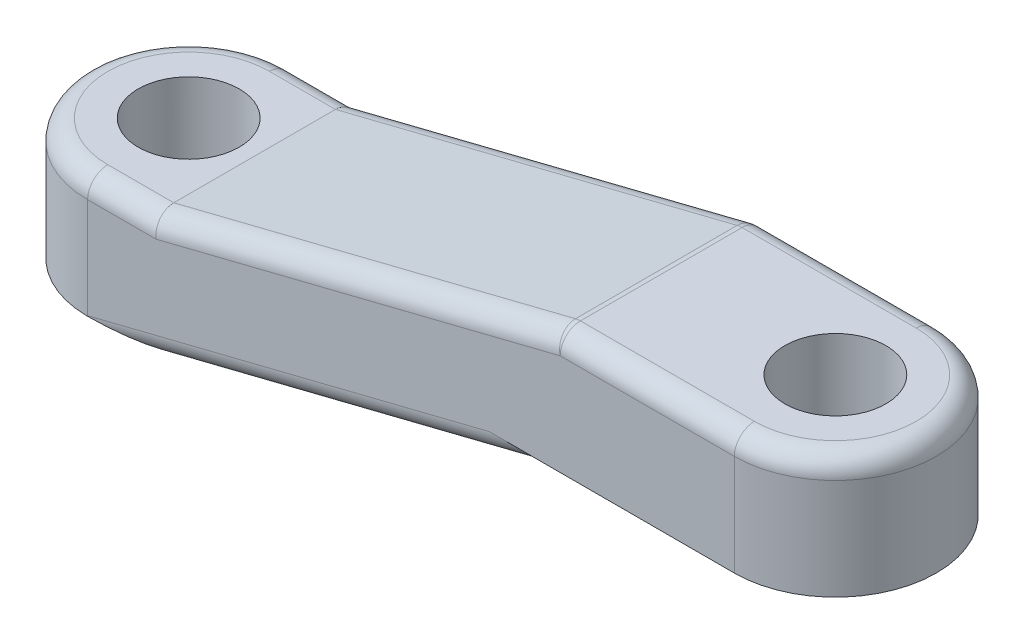
ISO-10303-21;
HEADER;
FILE_DESCRIPTION(('STEP AP214'),'2;1');
FILE_NAME('part.step','',(''),(''),'','','');
FILE_SCHEMA(('AUTOMOTIVE_DESIGN { 1 0 10303 214 1 1 1 1 }'));
ENDSEC;
DATA;
#1=APPLICATION_CONTEXT('core data for automotive mechanical design processes');
#2=APPLICATION_PROTOCOL_DEFINITION('international standard','automotive_design',2000,#1);
#3=PRODUCT_CONTEXT('',#1,'mechanical');
#4=PRODUCT('Part','Part','',(#3));
#5=PRODUCT_RELATED_PRODUCT_CATEGORY('part','',(#4));
#6=PRODUCT_DEFINITION_FORMATION('','',#4);
#7=PRODUCT_DEFINITION_CONTEXT('part definition',#1,'design');
#8=PRODUCT_DEFINITION('design','',#6,#7);
#9=PRODUCT_DEFINITION_SHAPE('','',#8);
#10=(LENGTH_UNIT() NAMED_UNIT(*) SI_UNIT(.MILLI.,.METRE.));
#11=(NAMED_UNIT(*) PLANE_ANGLE_UNIT() SI_UNIT($,.RADIAN.));
#12=(NAMED_UNIT(*) SI_UNIT($,.STERADIAN.) SOLID_ANGLE_UNIT());
#13=UNCERTAINTY_MEASURE_WITH_UNIT(LENGTH_MEASURE(1.E-05),#10,'distance_accuracy_value','');
#14=(GEOMETRIC_REPRESENTATION_CONTEXT(3) GLOBAL_UNCERTAINTY_ASSIGNED_CONTEXT((#13)) GLOBAL_UNIT_ASSIGNED_CONTEXT((#10,
#11,#12)) REPRESENTATION_CONTEXT('',''));
#15=CARTESIAN_POINT('',(0.,0.,0.));
#16=DIRECTION('',(0.,0.,1.));
#17=DIRECTION('',(1.,0.,0.));
#18=AXIS2_PLACEMENT_3D('',#15,#16,#17);
#19=CARTESIAN_POINT('',(-5.08,0.,12.7));
#20=DIRECTION('',(0.,1.,0.));
#21=DIRECTION('',(0.,0.,1.));
#22=AXIS2_PLACEMENT_3D('',#19,#20,#21);
#23=PLANE('',#22);
#24=CARTESIAN_POINT('',(-5.08,0.,6.35));
#25=DIRECTION('',(0.,1.,0.));
#26=DIRECTION('',(0.,0.,1.));
#27=AXIS2_PLACEMENT_3D('',#24,#25,#26);
#28=CIRCLE('',#27,3.175);
#29=CARTESIAN_POINT('',(-5.08,0.,9.525));
#30=VERTEX_POINT('',#29);
#31=EDGE_CURVE('E202',#30,#30,#28,.T.);
#32=ORIENTED_EDGE('',*,*,#31,.T.);
#33=EDGE_LOOP('',(#32));
#34=FACE_BOUND('',#33,.T.);
#35=CARTESIAN_POINT('',(-5.08,0.,6.35));
#36=DIRECTION('',(0.,1.,0.));
#37=DIRECTION('',(0.,0.,1.));
#38=AXIS2_PLACEMENT_3D('',#35,#36,#37);
#39=CIRCLE('',#38,6.35);
#40=CARTESIAN_POINT('',(-5.13497642502094,0.,12.6997620107128));
#41=VERTEX_POINT('',#40);
#42=CARTESIAN_POINT('',(-5.1349764249227,0.,0.00023798928734664));
#43=VERTEX_POINT('',#42);
#44=EDGE_CURVE('E175',#41,#43,#39,.F.);
#45=ORIENTED_EDGE('',*,*,#44,.T.);
#46=CARTESIAN_POINT('',(-5.23634414453443,0.,1.27));
#47=DIRECTION('',(0.,1.,0.));
#48=DIRECTION('',(1.,0.,0.));
#49=AXIS2_PLACEMENT_3D('',#46,#47,#48);
#50=ELLIPSE('',#49,5.23634414453443,1.27);
#51=CARTESIAN_POINT('',(0.,0.,1.27));
#52=VERTEX_POINT('',#51);
#53=EDGE_CURVE('E307',#43,#52,#50,.F.);
#54=ORIENTED_EDGE('',*,*,#53,.T.);
#55=DIRECTION('',(0.,0.,-1.));
#56=VECTOR('',#55,1.);
#57=CARTESIAN_POINT('',(0.,0.,12.7));
#58=LINE('',#57,#56);
#59=CARTESIAN_POINT('',(0.,0.,11.43));
#60=VERTEX_POINT('',#59);
#61=EDGE_CURVE('E195',#60,#52,#58,.T.);
#62=ORIENTED_EDGE('',*,*,#61,.F.);
#63=CARTESIAN_POINT('',(-5.23634414453443,0.,11.43));
#64=DIRECTION('',(0.,1.,0.));
#65=DIRECTION('',(-1.,0.,0.));
#66=AXIS2_PLACEMENT_3D('',#63,#64,#65);
#67=ELLIPSE('',#66,5.23634414453443,1.27);
#68=EDGE_CURVE('E311',#60,#41,#67,.F.);
#69=ORIENTED_EDGE('',*,*,#68,.T.);
#70=EDGE_LOOP('',(#45,#54,#62,#69));
#71=FACE_BOUND('',#70,.T.);
#72=ADVANCED_FACE('F43',(#34,#71),#23,.F.);
#73=CARTESIAN_POINT('',(0.,0.,12.7));
#74=DIRECTION('',(-0.242535625036333,0.970142500145332,0.));
#75=DIRECTION('',(-0.970142500145332,-0.242535625036333,0.));
#76=AXIS2_PLACEMENT_3D('',#73,#74,#75);
#77=PLANE('',#76);
#78=ORIENTED_EDGE('',*,*,#61,.T.);
#79=DIRECTION('',(0.970142500145332,0.242535625036333,0.));
#80=VECTOR('',#79,1.);
#81=CARTESIAN_POINT('',(0.,0.,1.27));
#82=LINE('',#81,#80);
#83=CARTESIAN_POINT('',(25.4,6.35,1.27));
#84=VERTEX_POINT('',#83);
#85=EDGE_CURVE('E204',#52,#84,#82,.T.);
#86=ORIENTED_EDGE('',*,*,#85,.T.);
#87=DIRECTION('',(0.,0.,-1.));
#88=VECTOR('',#87,1.);
#89=CARTESIAN_POINT('',(25.4,6.35,12.7));
#90=LINE('',#89,#88);
#91=CARTESIAN_POINT('',(25.4,6.35,11.43));
#92=VERTEX_POINT('',#91);
#93=EDGE_CURVE('E184',#92,#84,#90,.T.);
#94=ORIENTED_EDGE('',*,*,#93,.F.);
#95=DIRECTION('',(0.970142500145332,0.242535625036333,0.));
#96=VECTOR('',#95,1.);
#97=CARTESIAN_POINT('',(0.,0.,11.43));
#98=LINE('',#97,#96);
#99=EDGE_CURVE('E198',#92,#60,#98,.F.);
#100=ORIENTED_EDGE('',*,*,#99,.T.);
#101=EDGE_LOOP('',(#78,#86,#94,#100));
#102=FACE_BOUND('',#101,.T.);
#103=ADVANCED_FACE('F279',(#102),#77,.F.);
#104=CARTESIAN_POINT('',(25.4,6.35,12.7));
#105=DIRECTION('',(0.,1.,0.));
#106=DIRECTION('',(0.,0.,1.));
#107=AXIS2_PLACEMENT_3D('',#104,#105,#106);
#108=PLANE('',#107);
#109=CARTESIAN_POINT('',(35.56,6.35,6.35));
#110=DIRECTION('',(0.,1.,0.));
#111=DIRECTION('',(0.,0.,1.));
#112=AXIS2_PLACEMENT_3D('',#109,#110,#111);
#113=CIRCLE('',#112,3.175);
#114=CARTESIAN_POINT('',(35.56,6.35,9.525));
#115=VERTEX_POINT('',#114);
#116=EDGE_CURVE('E176',#115,#115,#113,.F.);
#117=ORIENTED_EDGE('',*,*,#116,.F.);
#118=EDGE_LOOP('',(#117));
#119=FACE_BOUND('',#118,.T.);
#120=DIRECTION('',(1.,0.,0.));
#121=VECTOR('',#120,1.);
#122=CARTESIAN_POINT('',(25.4,6.35,0.));
#123=LINE('',#122,#121);
#124=CARTESIAN_POINT('',(20.1636558554656,6.35,0.));
#125=VERTEX_POINT('',#124);
#126=CARTESIAN_POINT('',(35.56,6.35,0.));
#127=VERTEX_POINT('',#126);
#128=EDGE_CURVE('E171',#125,#127,#123,.T.);
#129=ORIENTED_EDGE('',*,*,#128,.T.);
#130=CARTESIAN_POINT('',(35.56,6.35,6.35));
#131=DIRECTION('',(0.,1.,0.));
#132=DIRECTION('',(0.,0.,1.));
#133=AXIS2_PLACEMENT_3D('',#130,#131,#132);
#134=CIRCLE('',#133,6.35);
#135=CARTESIAN_POINT('',(35.56,6.35,12.7));
#136=VERTEX_POINT('',#135);
#137=EDGE_CURVE('E168',#127,#136,#134,.F.);
#138=ORIENTED_EDGE('',*,*,#137,.T.);
#139=DIRECTION('',(1.,0.,0.));
#140=VECTOR('',#139,1.);
#141=CARTESIAN_POINT('',(25.4,6.35,12.7));
#142=LINE('',#141,#140);
#143=CARTESIAN_POINT('',(20.1636558554656,6.35,12.7));
#144=VERTEX_POINT('',#143);
#145=EDGE_CURVE('E154',#144,#136,#142,.T.);
#146=ORIENTED_EDGE('',*,*,#145,.F.);
#147=CARTESIAN_POINT('',(20.1636558554656,6.35,11.43));
#148=DIRECTION('',(0.,1.,0.));
#149=DIRECTION('',(-1.,0.,0.));
#150=AXIS2_PLACEMENT_3D('',#147,#148,#149);
#151=ELLIPSE('',#150,5.23634414453443,1.27);
#152=EDGE_CURVE('E327',#144,#92,#151,.T.);
#153=ORIENTED_EDGE('',*,*,#152,.T.);
#154=ORIENTED_EDGE('',*,*,#93,.T.);
#155=CARTESIAN_POINT('',(20.1636558554656,6.35,1.27));
#156=DIRECTION('',(0.,1.,0.));
#157=DIRECTION('',(1.,0.,0.));
#158=AXIS2_PLACEMENT_3D('',#155,#156,#157);
#159=ELLIPSE('',#158,5.23634414453443,1.27);
#160=EDGE_CURVE('E325',#84,#125,#159,.T.);
#161=ORIENTED_EDGE('',*,*,#160,.T.);
#162=EDGE_LOOP('',(#129,#138,#146,#153,#154,#161));
#163=FACE_BOUND('',#162,.T.);
#164=ADVANCED_FACE('F169',(#119,#163),#108,.F.);
#165=CARTESIAN_POINT('',(24.4619351327934,13.97,12.7));
#166=DIRECTION('',(0.,-1.,0.));
#167=DIRECTION('',(0.,0.,-1.));
#168=AXIS2_PLACEMENT_3D('',#165,#166,#167);
#169=PLANE('',#168);
#170=DIRECTION('',(0.,0.,-1.));
#171=VECTOR('',#170,1.);
#172=CARTESIAN_POINT('',(24.6182792773279,13.97,12.7));
#173=LINE('',#172,#171);
#174=CARTESIAN_POINT('',(24.6182792773279,13.97,1.27));
#175=VERTEX_POINT('',#174);
#176=CARTESIAN_POINT('',(24.6182792773279,13.97,11.43));
#177=VERTEX_POINT('',#176);
#178=EDGE_CURVE('E337',#175,#177,#173,.F.);
#179=ORIENTED_EDGE('',*,*,#178,.T.);
#180=DIRECTION('',(-1.,0.,0.));
#181=VECTOR('',#180,1.);
#182=CARTESIAN_POINT('',(35.56,13.97,11.43));
#183=LINE('',#182,#181);
#184=CARTESIAN_POINT('',(35.56,13.97,11.43));
#185=VERTEX_POINT('',#184);
#186=EDGE_CURVE('E339',#177,#185,#183,.F.);
#187=ORIENTED_EDGE('',*,*,#186,.T.);
#188=CARTESIAN_POINT('',(35.56,13.97,6.35));
#189=DIRECTION('',(0.,-1.,0.));
#190=DIRECTION('',(0.,0.,-1.));
#191=AXIS2_PLACEMENT_3D('',#188,#189,#190);
#192=CIRCLE('',#191,5.08);
#193=CARTESIAN_POINT('',(35.56,13.97,1.27));
#194=VERTEX_POINT('',#193);
#195=EDGE_CURVE('E333',#185,#194,#192,.F.);
#196=ORIENTED_EDGE('',*,*,#195,.T.);
#197=DIRECTION('',(-1.,0.,0.));
#198=VECTOR('',#197,1.);
#199=CARTESIAN_POINT('',(24.4619351327934,13.97,1.27));
#200=LINE('',#199,#198);
#201=EDGE_CURVE('E335',#194,#175,#200,.T.);
#202=ORIENTED_EDGE('',*,*,#201,.T.);
#203=EDGE_LOOP('',(#179,#187,#196,#202));
#204=FACE_BOUND('',#203,.T.);
#205=CARTESIAN_POINT('',(35.56,13.97,6.35));
#206=DIRECTION('',(0.,1.,0.));
#207=DIRECTION('',(0.,0.,1.));
#208=AXIS2_PLACEMENT_3D('',#205,#206,#207);
#209=CIRCLE('',#208,3.175);
#210=CARTESIAN_POINT('',(35.56,13.97,9.525));
#211=VERTEX_POINT('',#210);
#212=EDGE_CURVE('E377',#211,#211,#209,.T.);
#213=ORIENTED_EDGE('',*,*,#212,.F.);
#214=EDGE_LOOP('',(#213));
#215=FACE_BOUND('',#214,.T.);
#216=ADVANCED_FACE('F398',(#204,#215),#169,.F.);
#217=CARTESIAN_POINT('',(-0.938064867206577,7.62,12.7));
#218=DIRECTION('',(0.242535625036333,-0.970142500145332,0.));
#219=DIRECTION('',(0.970142500145332,0.242535625036333,0.));
#220=AXIS2_PLACEMENT_3D('',#217,#218,#219);
#221=PLANE('',#220);
#222=DIRECTION('',(-0.970142500145332,-0.242535625036333,0.));
#223=VECTOR('',#222,1.);
#224=CARTESIAN_POINT('',(24.4619351327934,13.97,11.43));
#225=LINE('',#224,#223);
#226=CARTESIAN_POINT('',(-0.938064867206577,7.62,11.43));
#227=VERTEX_POINT('',#226);
#228=CARTESIAN_POINT('',(24.3102590335317,13.9320809751846,11.43));
#229=VERTEX_POINT('',#228);
#230=EDGE_CURVE('E314',#227,#229,#225,.F.);
#231=ORIENTED_EDGE('',*,*,#230,.T.);
#232=DIRECTION('',(0.,0.,-1.));
#233=VECTOR('',#232,1.);
#234=CARTESIAN_POINT('',(24.3102590335317,13.9320809751846,12.7));
#235=LINE('',#234,#233);
#236=CARTESIAN_POINT('',(24.3102590335317,13.9320809751846,1.27));
#237=VERTEX_POINT('',#236);
#238=EDGE_CURVE('E344',#229,#237,#235,.T.);
#239=ORIENTED_EDGE('',*,*,#238,.T.);
#240=DIRECTION('',(-0.970142500145332,-0.242535625036333,0.));
#241=VECTOR('',#240,1.);
#242=CARTESIAN_POINT('',(-0.938064867206577,7.62,1.27));
#243=LINE('',#242,#241);
#244=CARTESIAN_POINT('',(-0.938064867206577,7.62,1.27));
#245=VERTEX_POINT('',#244);
#246=EDGE_CURVE('E319',#237,#245,#243,.T.);
#247=ORIENTED_EDGE('',*,*,#246,.T.);
#248=DIRECTION('',(0.,0.,-1.));
#249=VECTOR('',#248,1.);
#250=CARTESIAN_POINT('',(-0.938064867206577,7.62,12.7));
#251=LINE('',#250,#249);
#252=EDGE_CURVE('E181',#227,#245,#251,.T.);
#253=ORIENTED_EDGE('',*,*,#252,.F.);
#254=EDGE_LOOP('',(#231,#239,#247,#253));
#255=FACE_BOUND('',#254,.T.);
#256=ADVANCED_FACE('F387',(#255),#221,.F.);
#257=CARTESIAN_POINT('',(-5.08,7.62,12.7));
#258=DIRECTION('',(0.,-1.,0.));
#259=DIRECTION('',(0.,0.,-1.));
#260=AXIS2_PLACEMENT_3D('',#257,#258,#259);
#261=PLANE('',#260);
#262=ORIENTED_EDGE('',*,*,#252,.T.);
#263=DIRECTION('',(-1.,0.,0.));
#264=VECTOR('',#263,1.);
#265=CARTESIAN_POINT('',(-5.08,7.62,1.27));
#266=LINE('',#265,#264);
#267=CARTESIAN_POINT('',(-5.08,7.62,1.27));
#268=VERTEX_POINT('',#267);
#269=EDGE_CURVE('E356',#245,#268,#266,.T.);
#270=ORIENTED_EDGE('',*,*,#269,.T.);
#271=CARTESIAN_POINT('',(-5.08,7.62,6.35));
#272=DIRECTION('',(0.,-1.,0.));
#273=DIRECTION('',(0.,0.,-1.));
#274=AXIS2_PLACEMENT_3D('',#271,#272,#273);
#275=CIRCLE('',#274,5.08);
#276=CARTESIAN_POINT('',(-5.08,7.62,11.43));
#277=VERTEX_POINT('',#276);
#278=EDGE_CURVE('E60',#268,#277,#275,.F.);
#279=ORIENTED_EDGE('',*,*,#278,.T.);
#280=DIRECTION('',(-1.,0.,0.));
#281=VECTOR('',#280,1.);
#282=CARTESIAN_POINT('',(4.29827927732785,7.62,11.43));
#283=LINE('',#282,#281);
#284=EDGE_CURVE('E354',#277,#227,#283,.F.);
#285=ORIENTED_EDGE('',*,*,#284,.T.);
#286=EDGE_LOOP('',(#262,#270,#279,#285));
#287=FACE_BOUND('',#286,.T.);
#288=CARTESIAN_POINT('',(-5.08,7.62,6.35));
#289=DIRECTION('',(0.,-1.,0.));
#290=DIRECTION('',(0.,0.,-1.));
#291=AXIS2_PLACEMENT_3D('',#288,#289,#290);
#292=CIRCLE('',#291,3.175);
#293=CARTESIAN_POINT('',(-5.08,7.62,3.175));
#294=VERTEX_POINT('',#293);
#295=EDGE_CURVE('E199',#294,#294,#292,.F.);
#296=ORIENTED_EDGE('',*,*,#295,.F.);
#297=EDGE_LOOP('',(#296));
#298=FACE_BOUND('',#297,.T.);
#299=ADVANCED_FACE('F383',(#287,#298),#261,.F.);
#300=CARTESIAN_POINT('',(0.,0.,12.7));
#301=DIRECTION('',(0.,0.,1.));
#302=DIRECTION('',(1.,0.,0.));
#303=AXIS2_PLACEMENT_3D('',#300,#301,#302);
#304=PLANE('',#303);
#305=DIRECTION('',(0.,1.,0.));
#306=VECTOR('',#305,1.);
#307=CARTESIAN_POINT('',(35.56,13.97,12.7));
#308=LINE('',#307,#306);
#309=CARTESIAN_POINT('',(35.56,12.7,12.7));
#310=VERTEX_POINT('',#309);
#311=EDGE_CURVE('E159',#136,#310,#308,.T.);
#312=ORIENTED_EDGE('',*,*,#311,.T.);
#313=DIRECTION('',(-1.,0.,0.));
#314=VECTOR('',#313,1.);
#315=CARTESIAN_POINT('',(29.6982792773279,12.7,12.7));
#316=LINE('',#315,#314);
#317=CARTESIAN_POINT('',(24.6182792773279,12.7,12.7));
#318=VERTEX_POINT('',#317);
#319=EDGE_CURVE('E331',#310,#318,#316,.T.);
#320=ORIENTED_EDGE('',*,*,#319,.T.);
#321=DIRECTION('',(-0.970142500145332,-0.242535625036333,0.));
#322=VECTOR('',#321,1.);
#323=CARTESIAN_POINT('',(-0.630044623410434,6.38791902481543,12.7));
#324=LINE('',#323,#322);
#325=CARTESIAN_POINT('',(-0.781720722672151,6.35,12.7));
#326=VERTEX_POINT('',#325);
#327=EDGE_CURVE('E322',#318,#326,#324,.T.);
#328=ORIENTED_EDGE('',*,*,#327,.T.);
#329=DIRECTION('',(-1.,0.,0.));
#330=VECTOR('',#329,1.);
#331=CARTESIAN_POINT('',(-5.08,6.35,12.7));
#332=LINE('',#331,#330);
#333=CARTESIAN_POINT('',(-5.08,6.35,12.7));
#334=VERTEX_POINT('',#333);
#335=EDGE_CURVE('E329',#326,#334,#332,.T.);
#336=ORIENTED_EDGE('',*,*,#335,.T.);
#337=DIRECTION('',(0.,-1.,0.));
#338=VECTOR('',#337,1.);
#339=CARTESIAN_POINT('',(-5.08,7.62,12.7));
#340=LINE('',#339,#338);
#341=CARTESIAN_POINT('',(-5.08,0.0390860361336081,12.7));
#342=VERTEX_POINT('',#341);
#343=EDGE_CURVE('E165',#334,#342,#340,.T.);
#344=ORIENTED_EDGE('',*,*,#343,.T.);
#345=DIRECTION('',(0.970142500145332,0.242535625036333,0.));
#346=VECTOR('',#345,1.);
#347=CARTESIAN_POINT('',(25.0919797562039,7.58208097518457,12.7));
#348=LINE('',#347,#346);
#349=EDGE_CURVE('E162',#342,#144,#348,.T.);
#350=ORIENTED_EDGE('',*,*,#349,.T.);
#351=ORIENTED_EDGE('',*,*,#145,.T.);
#352=EDGE_LOOP('',(#312,#320,#328,#336,#344,#350,#351));
#353=FACE_BOUND('',#352,.T.);
#354=ADVANCED_FACE('F156',(#353),#304,.T.);
#355=CARTESIAN_POINT('',(0.,0.,0.));
#356=DIRECTION('',(0.,0.,1.));
#357=DIRECTION('',(1.,0.,0.));
#358=AXIS2_PLACEMENT_3D('',#355,#356,#357);
#359=PLANE('',#358);
#360=DIRECTION('',(-0.970142500145332,-0.242535625036333,0.));
#361=VECTOR('',#360,1.);
#362=CARTESIAN_POINT('',(-1.54010121898071,6.16040487592286,0.));
#363=LINE('',#362,#361);
#364=CARTESIAN_POINT('',(-0.781720722672144,6.35,0.));
#365=VERTEX_POINT('',#364);
#366=CARTESIAN_POINT('',(24.6182792773279,12.7,0.));
#367=VERTEX_POINT('',#366);
#368=EDGE_CURVE('E207',#365,#367,#363,.F.);
#369=ORIENTED_EDGE('',*,*,#368,.T.);
#370=DIRECTION('',(-1.,0.,0.));
#371=VECTOR('',#370,1.);
#372=CARTESIAN_POINT('',(0.,12.7,0.));
#373=LINE('',#372,#371);
#374=CARTESIAN_POINT('',(35.56,12.7,0.));
#375=VERTEX_POINT('',#374);
#376=EDGE_CURVE('E351',#367,#375,#373,.F.);
#377=ORIENTED_EDGE('',*,*,#376,.T.);
#378=DIRECTION('',(0.,1.,0.));
#379=VECTOR('',#378,1.);
#380=CARTESIAN_POINT('',(35.56,13.97,0.));
#381=LINE('',#380,#379);
#382=EDGE_CURVE('E191',#127,#375,#381,.T.);
#383=ORIENTED_EDGE('',*,*,#382,.F.);
#384=ORIENTED_EDGE('',*,*,#128,.F.);
#385=DIRECTION('',(0.970142500145332,0.242535625036333,0.));
#386=VECTOR('',#385,1.);
#387=CARTESIAN_POINT('',(-0.308020243796143,1.23208097518457,0.));
#388=LINE('',#387,#386);
#389=CARTESIAN_POINT('',(-5.08,0.0390860361336089,0.));
#390=VERTEX_POINT('',#389);
#391=EDGE_CURVE('E210',#125,#390,#388,.F.);
#392=ORIENTED_EDGE('',*,*,#391,.T.);
#393=DIRECTION('',(0.,-1.,0.));
#394=VECTOR('',#393,1.);
#395=CARTESIAN_POINT('',(-5.08,7.62,0.));
#396=LINE('',#395,#394);
#397=CARTESIAN_POINT('',(-5.08,6.35,0.));
#398=VERTEX_POINT('',#397);
#399=EDGE_CURVE('E188',#398,#390,#396,.T.);
#400=ORIENTED_EDGE('',*,*,#399,.F.);
#401=DIRECTION('',(-1.,0.,0.));
#402=VECTOR('',#401,1.);
#403=CARTESIAN_POINT('',(0.,6.35,0.));
#404=LINE('',#403,#402);
#405=EDGE_CURVE('E348',#398,#365,#404,.F.);
#406=ORIENTED_EDGE('',*,*,#405,.T.);
#407=EDGE_LOOP('',(#369,#377,#383,#384,#392,#400,#406));
#408=FACE_BOUND('',#407,.T.);
#409=ADVANCED_FACE('F409',(#408),#359,.F.);
#410=CARTESIAN_POINT('',(-5.08,-14.1990316571237,6.35));
#411=DIRECTION('',(0.,1.,0.));
#412=DIRECTION('',(0.,0.,1.));
#413=AXIS2_PLACEMENT_3D('',#410,#411,#412);
#414=CYLINDRICAL_SURFACE('',#413,6.35);
#415=ORIENTED_EDGE('',*,*,#343,.F.);
#416=CARTESIAN_POINT('',(-5.08,6.35,6.35));
#417=DIRECTION('',(0.,-1.,0.));
#418=DIRECTION('',(0.,0.,-1.));
#419=AXIS2_PLACEMENT_3D('',#416,#417,#418);
#420=CIRCLE('',#419,6.35);
#421=EDGE_CURVE('E359',#334,#398,#420,.T.);
#422=ORIENTED_EDGE('',*,*,#421,.T.);
#423=ORIENTED_EDGE('',*,*,#399,.T.);
#424=CARTESIAN_POINT('',(-5.13497642502028,0.,0.000237989287157556));
#425=CARTESIAN_POINT('',(-5.12109177199258,0.00987113413457907,0.00011777755086104));
#426=CARTESIAN_POINT('',(-5.10720712839361,0.0197424873696676,4.31062936630522E-05));
#427=CARTESIAN_POINT('',(-5.08888166185105,0.0327713627682106,4.65838838338354E-06));
#428=CARTESIAN_POINT('',(-5.08444083044327,0.0359286882443244,-1.16804444295617E-10));
#429=CARTESIAN_POINT('',(-5.08,0.0390860361336072,0.));
#430=B_SPLINE_CURVE_WITH_KNOTS('',3,(#424,#425,#426,#427,#428,#429),.UNSPECIFIED.,.F.,.F.,(4,2,
4),(0.,0.0511086359163592,0.0674551152041372),.UNSPECIFIED.);
#431=EDGE_CURVE('E222',#390,#43,#430,.F.);
#432=ORIENTED_EDGE('',*,*,#431,.T.);
#433=ORIENTED_EDGE('',*,*,#44,.F.);
#434=CARTESIAN_POINT('',(-5.13497642502094,0.,12.6997620107128));
#435=CARTESIAN_POINT('',(-5.12109177199312,0.00987113413472761,12.6998822224491));
#436=CARTESIAN_POINT('',(-5.10720712839397,0.019742487369871,12.6999568937063));
#437=CARTESIAN_POINT('',(-5.08888166185114,0.0327713627683297,12.6999953416116));
#438=CARTESIAN_POINT('',(-5.08444083044331,0.0359286882443886,12.7000000001168));
#439=CARTESIAN_POINT('',(-5.08,0.0390860361336069,12.7));
#440=B_SPLINE_CURVE_WITH_KNOTS('',3,(#434,#435,#436,#437,#438,#439),.UNSPECIFIED.,.F.,.F.,(4,2,
4),(0.,0.0511086359168935,0.0674551152046722),.UNSPECIFIED.);
#441=EDGE_CURVE('E213',#41,#342,#440,.T.);
#442=ORIENTED_EDGE('',*,*,#441,.T.);
#443=EDGE_LOOP('',(#415,#422,#423,#432,#433,#442));
#444=FACE_BOUND('',#443,.T.);
#445=ADVANCED_FACE('F229',(#444),#414,.T.);
#446=CARTESIAN_POINT('',(35.56,-7.84903165712366,6.35));
#447=DIRECTION('',(0.,1.,0.));
#448=DIRECTION('',(0.,0.,1.));
#449=AXIS2_PLACEMENT_3D('',#446,#447,#448);
#450=CYLINDRICAL_SURFACE('',#449,6.35);
#451=ORIENTED_EDGE('',*,*,#382,.T.);
#452=CARTESIAN_POINT('',(35.56,12.7,6.35));
#453=DIRECTION('',(0.,-1.,0.));
#454=DIRECTION('',(0.,0.,-1.));
#455=AXIS2_PLACEMENT_3D('',#452,#453,#454);
#456=CIRCLE('',#455,6.35);
#457=EDGE_CURVE('E180',#375,#310,#456,.T.);
#458=ORIENTED_EDGE('',*,*,#457,.T.);
#459=ORIENTED_EDGE('',*,*,#311,.F.);
#460=ORIENTED_EDGE('',*,*,#137,.F.);
#461=EDGE_LOOP('',(#451,#458,#459,#460));
#462=FACE_BOUND('',#461,.T.);
#463=ADVANCED_FACE('F178',(#462),#450,.T.);
#464=CARTESIAN_POINT('',(-5.08,13.97,6.35));
#465=DIRECTION('',(0.,-1.,0.));
#466=DIRECTION('',(0.,0.,-1.));
#467=AXIS2_PLACEMENT_3D('',#464,#465,#466);
#468=CYLINDRICAL_SURFACE('',#467,3.175);
#469=ORIENTED_EDGE('',*,*,#31,.F.);
#470=EDGE_LOOP('',(#469));
#471=FACE_BOUND('',#470,.T.);
#472=ORIENTED_EDGE('',*,*,#295,.T.);
#473=EDGE_LOOP('',(#472));
#474=FACE_BOUND('',#473,.T.);
#475=ADVANCED_FACE('F300',(#471,#474),#468,.F.);
#476=CARTESIAN_POINT('',(35.56,13.97,6.35));
#477=DIRECTION('',(0.,-1.,0.));
#478=DIRECTION('',(0.,0.,-1.));
#479=AXIS2_PLACEMENT_3D('',#476,#477,#478);
#480=CYLINDRICAL_SURFACE('',#479,3.175);
#481=ORIENTED_EDGE('',*,*,#212,.T.);
#482=EDGE_LOOP('',(#481));
#483=FACE_BOUND('',#482,.T.);
#484=ORIENTED_EDGE('',*,*,#116,.T.);
#485=EDGE_LOOP('',(#484));
#486=FACE_BOUND('',#485,.T.);
#487=ADVANCED_FACE('F293',(#483,#486),#480,.F.);
#488=CARTESIAN_POINT('',(-0.308020243796143,1.23208097518457,1.27));
#489=DIRECTION('',(0.970142500145332,0.242535625036333,0.));
#490=DIRECTION('',(-0.242535625036333,0.970142500145332,0.));
#491=AXIS2_PLACEMENT_3D('',#488,#489,#490);
#492=CYLINDRICAL_SURFACE('',#491,1.27);
#493=ORIENTED_EDGE('',*,*,#431,.F.);
#494=ORIENTED_EDGE('',*,*,#391,.F.);
#495=ORIENTED_EDGE('',*,*,#160,.F.);
#496=ORIENTED_EDGE('',*,*,#85,.F.);
#497=ORIENTED_EDGE('',*,*,#53,.F.);
#498=EDGE_LOOP('',(#493,#494,#495,#496,#497));
#499=FACE_BOUND('',#498,.T.);
#500=ADVANCED_FACE('F290',(#499),#492,.T.);
#501=CARTESIAN_POINT('',(-0.630044623410434,6.38791902481543,1.27));
#502=DIRECTION('',(-0.970142500145332,-0.242535625036333,0.));
#503=DIRECTION('',(0.242535625036333,-0.970142500145332,0.));
#504=AXIS2_PLACEMENT_3D('',#501,#502,#503);
#505=CYLINDRICAL_SURFACE('',#504,1.27);
#506=ORIENTED_EDGE('',*,*,#246,.F.);
#507=CARTESIAN_POINT('',(24.6182792773279,12.7,1.27));
#508=DIRECTION('',(-0.970142500145332,-0.242535625036333,0.));
#509=DIRECTION('',(0.242535625036333,-0.970142500145332,0.));
#510=AXIS2_PLACEMENT_3D('',#507,#508,#509);
#511=CIRCLE('',#510,1.27);
#512=EDGE_CURVE('E346',#237,#367,#511,.T.);
#513=ORIENTED_EDGE('',*,*,#512,.T.);
#514=ORIENTED_EDGE('',*,*,#368,.F.);
#515=CARTESIAN_POINT('',(-0.781720722672153,6.35,1.27));
#516=DIRECTION('',(-0.992507556682903,-0.122183263695704,0.));
#517=DIRECTION('',(-0.122183263695705,0.992507556682903,0.));
#518=AXIS2_PLACEMENT_3D('',#515,#516,#517);
#519=ELLIPSE('',#518,1.27958723482622,1.27);
#520=EDGE_CURVE('E52',#365,#245,#519,.F.);
#521=ORIENTED_EDGE('',*,*,#520,.T.);
#522=EDGE_LOOP('',(#506,#513,#514,#521));
#523=FACE_BOUND('',#522,.T.);
#524=ADVANCED_FACE('F239',(#523),#505,.T.);
#525=CARTESIAN_POINT('',(-0.308020243796143,1.23208097518457,11.43));
#526=DIRECTION('',(-0.970142500145332,-0.242535625036333,0.));
#527=DIRECTION('',(0.242535625036333,-0.970142500145332,0.));
#528=AXIS2_PLACEMENT_3D('',#525,#526,#527);
#529=CYLINDRICAL_SURFACE('',#528,1.27);
#530=ORIENTED_EDGE('',*,*,#68,.F.);
#531=ORIENTED_EDGE('',*,*,#99,.F.);
#532=ORIENTED_EDGE('',*,*,#152,.F.);
#533=ORIENTED_EDGE('',*,*,#349,.F.);
#534=ORIENTED_EDGE('',*,*,#441,.F.);
#535=EDGE_LOOP('',(#530,#531,#532,#533,#534));
#536=FACE_BOUND('',#535,.T.);
#537=ADVANCED_FACE('F233',(#536),#529,.T.);
#538=CARTESIAN_POINT('',(-1.54010121898071,6.16040487592286,11.43));
#539=DIRECTION('',(0.970142500145332,0.242535625036333,0.));
#540=DIRECTION('',(-0.242535625036333,0.970142500145332,0.));
#541=AXIS2_PLACEMENT_3D('',#538,#539,#540);
#542=CYLINDRICAL_SURFACE('',#541,1.27);
#543=ORIENTED_EDGE('',*,*,#327,.F.);
#544=CARTESIAN_POINT('',(24.6182792773279,12.7,11.43));
#545=DIRECTION('',(0.970142500145332,0.242535625036333,0.));
#546=DIRECTION('',(-0.242535625036333,0.970142500145332,0.));
#547=AXIS2_PLACEMENT_3D('',#544,#545,#546);
#548=CIRCLE('',#547,1.27);
#549=EDGE_CURVE('E342',#318,#229,#548,.F.);
#550=ORIENTED_EDGE('',*,*,#549,.T.);
#551=ORIENTED_EDGE('',*,*,#230,.F.);
#552=CARTESIAN_POINT('',(-0.781720722672151,6.35,11.43));
#553=DIRECTION('',(0.992507556682903,0.122183263695704,0.));
#554=DIRECTION('',(0.122183263695705,-0.992507556682903,0.));
#555=AXIS2_PLACEMENT_3D('',#552,#553,#554);
#556=ELLIPSE('',#555,1.27958723482622,1.27);
#557=EDGE_CURVE('E11',#227,#326,#556,.T.);
#558=ORIENTED_EDGE('',*,*,#557,.T.);
#559=EDGE_LOOP('',(#543,#550,#551,#558));
#560=FACE_BOUND('',#559,.T.);
#561=ADVANCED_FACE('F238',(#560),#542,.T.);
#562=CARTESIAN_POINT('',(24.6182792773279,12.7,1.27));
#563=DIRECTION('',(0.,-1.,0.));
#564=DIRECTION('',(0.,0.,-1.));
#565=AXIS2_PLACEMENT_3D('',#562,#563,#564);
#566=SPHERICAL_SURFACE('',#565,1.27);
#567=CARTESIAN_POINT('',(24.6182792773279,12.7,1.27));
#568=DIRECTION('',(0.,0.,1.));
#569=DIRECTION('',(1.,0.,0.));
#570=AXIS2_PLACEMENT_3D('',#567,#568,#569);
#571=CIRCLE('',#570,1.27);
#572=EDGE_CURVE('E372',#175,#237,#571,.T.);
#573=ORIENTED_EDGE('',*,*,#572,.F.);
#574=CARTESIAN_POINT('',(24.6182792773279,12.7,1.27));
#575=DIRECTION('',(1.,0.,0.));
#576=DIRECTION('',(0.,0.,-1.));
#577=AXIS2_PLACEMENT_3D('',#574,#575,#576);
#578=CIRCLE('',#577,1.27);
#579=EDGE_CURVE('E375',#367,#175,#578,.T.);
#580=ORIENTED_EDGE('',*,*,#579,.F.);
#581=ORIENTED_EDGE('',*,*,#512,.F.);
#582=EDGE_LOOP('',(#573,#580,#581));
#583=FACE_BOUND('',#582,.T.);
#584=ADVANCED_FACE('F243',(#583),#566,.T.);
#585=CARTESIAN_POINT('',(24.4619351327934,12.7,1.27));
#586=DIRECTION('',(-1.,0.,0.));
#587=DIRECTION('',(0.,0.,1.));
#588=AXIS2_PLACEMENT_3D('',#585,#586,#587);
#589=CYLINDRICAL_SURFACE('',#588,1.27);
#590=ORIENTED_EDGE('',*,*,#579,.T.);
#591=ORIENTED_EDGE('',*,*,#201,.F.);
#592=CARTESIAN_POINT('',(35.56,12.7,1.27));
#593=DIRECTION('',(1.,0.,0.));
#594=DIRECTION('',(0.,0.,-1.));
#595=AXIS2_PLACEMENT_3D('',#592,#593,#594);
#596=CIRCLE('',#595,1.27);
#597=EDGE_CURVE('E369',#375,#194,#596,.T.);
#598=ORIENTED_EDGE('',*,*,#597,.F.);
#599=ORIENTED_EDGE('',*,*,#376,.F.);
#600=EDGE_LOOP('',(#590,#591,#598,#599));
#601=FACE_BOUND('',#600,.T.);
#602=ADVANCED_FACE('F260',(#601),#589,.T.);
#603=CARTESIAN_POINT('',(24.6182792773279,12.7,12.7));
#604=DIRECTION('',(0.,0.,-1.));
#605=DIRECTION('',(-1.,0.,0.));
#606=AXIS2_PLACEMENT_3D('',#603,#604,#605);
#607=CYLINDRICAL_SURFACE('',#606,1.27);
#608=ORIENTED_EDGE('',*,*,#572,.T.);
#609=ORIENTED_EDGE('',*,*,#238,.F.);
#610=CARTESIAN_POINT('',(24.6182792773279,12.7,11.43));
#611=DIRECTION('',(0.,0.,1.));
#612=DIRECTION('',(1.,0.,0.));
#613=AXIS2_PLACEMENT_3D('',#610,#611,#612);
#614=CIRCLE('',#613,1.27);
#615=EDGE_CURVE('E366',#177,#229,#614,.T.);
#616=ORIENTED_EDGE('',*,*,#615,.F.);
#617=ORIENTED_EDGE('',*,*,#178,.F.);
#618=EDGE_LOOP('',(#608,#609,#616,#617));
#619=FACE_BOUND('',#618,.T.);
#620=ADVANCED_FACE('F256',(#619),#607,.T.);
#621=CARTESIAN_POINT('',(35.56,12.7,6.35));
#622=DIRECTION('',(0.,-1.,0.));
#623=DIRECTION('',(0.,0.,-1.));
#624=AXIS2_PLACEMENT_3D('',#621,#622,#623);
#625=TOROIDAL_SURFACE('',#624,5.08,1.27);
#626=ORIENTED_EDGE('',*,*,#597,.T.);
#627=ORIENTED_EDGE('',*,*,#195,.F.);
#628=CARTESIAN_POINT('',(35.56,12.7,11.43));
#629=DIRECTION('',(-1.,0.,0.));
#630=DIRECTION('',(0.,0.,1.));
#631=AXIS2_PLACEMENT_3D('',#628,#629,#630);
#632=CIRCLE('',#631,1.27);
#633=EDGE_CURVE('E364',#310,#185,#632,.T.);
#634=ORIENTED_EDGE('',*,*,#633,.F.);
#635=ORIENTED_EDGE('',*,*,#457,.F.);
#636=EDGE_LOOP('',(#626,#627,#634,#635));
#637=FACE_BOUND('',#636,.T.);
#638=ADVANCED_FACE('F252',(#637),#625,.T.);
#639=CARTESIAN_POINT('',(24.6182792773279,12.7,11.43));
#640=DIRECTION('',(0.,-1.,0.));
#641=DIRECTION('',(0.,0.,-1.));
#642=AXIS2_PLACEMENT_3D('',#639,#640,#641);
#643=SPHERICAL_SURFACE('',#642,1.27);
#644=ORIENTED_EDGE('',*,*,#615,.T.);
#645=ORIENTED_EDGE('',*,*,#549,.F.);
#646=CARTESIAN_POINT('',(24.6182792773279,12.7,11.43));
#647=DIRECTION('',(1.,0.,0.));
#648=DIRECTION('',(0.,0.,-1.));
#649=AXIS2_PLACEMENT_3D('',#646,#647,#648);
#650=CIRCLE('',#649,1.27);
#651=EDGE_CURVE('E362',#177,#318,#650,.T.);
#652=ORIENTED_EDGE('',*,*,#651,.F.);
#653=EDGE_LOOP('',(#644,#645,#652));
#654=FACE_BOUND('',#653,.T.);
#655=ADVANCED_FACE('F248',(#654),#643,.T.);
#656=CARTESIAN_POINT('',(0.,12.7,11.43));
#657=DIRECTION('',(1.,0.,0.));
#658=DIRECTION('',(0.,0.,-1.));
#659=AXIS2_PLACEMENT_3D('',#656,#657,#658);
#660=CYLINDRICAL_SURFACE('',#659,1.27);
#661=ORIENTED_EDGE('',*,*,#633,.T.);
#662=ORIENTED_EDGE('',*,*,#186,.F.);
#663=ORIENTED_EDGE('',*,*,#651,.T.);
#664=ORIENTED_EDGE('',*,*,#319,.F.);
#665=EDGE_LOOP('',(#661,#662,#663,#664));
#666=FACE_BOUND('',#665,.T.);
#667=ADVANCED_FACE('F245',(#666),#660,.T.);
#668=CARTESIAN_POINT('',(0.,6.35,11.43));
#669=DIRECTION('',(1.,0.,0.));
#670=DIRECTION('',(0.,0.,-1.));
#671=AXIS2_PLACEMENT_3D('',#668,#669,#670);
#672=CYLINDRICAL_SURFACE('',#671,1.27);
#673=ORIENTED_EDGE('',*,*,#557,.F.);
#674=ORIENTED_EDGE('',*,*,#284,.F.);
#675=CARTESIAN_POINT('',(-5.08,6.35,11.43));
#676=DIRECTION('',(-1.,0.,0.));
#677=DIRECTION('',(0.,0.,1.));
#678=AXIS2_PLACEMENT_3D('',#675,#676,#677);
#679=CIRCLE('',#678,1.27);
#680=EDGE_CURVE('E47',#334,#277,#679,.T.);
#681=ORIENTED_EDGE('',*,*,#680,.F.);
#682=ORIENTED_EDGE('',*,*,#335,.F.);
#683=EDGE_LOOP('',(#673,#674,#681,#682));
#684=FACE_BOUND('',#683,.T.);
#685=ADVANCED_FACE('F45',(#684),#672,.T.);
#686=CARTESIAN_POINT('',(-5.08,6.35,6.35));
#687=DIRECTION('',(0.,-1.,0.));
#688=DIRECTION('',(0.,0.,-1.));
#689=AXIS2_PLACEMENT_3D('',#686,#687,#688);
#690=TOROIDAL_SURFACE('',#689,5.08,1.27);
#691=ORIENTED_EDGE('',*,*,#680,.T.);
#692=ORIENTED_EDGE('',*,*,#278,.F.);
#693=CARTESIAN_POINT('',(-5.08,6.35,1.27));
#694=DIRECTION('',(1.,0.,0.));
#695=DIRECTION('',(0.,0.,-1.));
#696=AXIS2_PLACEMENT_3D('',#693,#694,#695);
#697=CIRCLE('',#696,1.27);
#698=EDGE_CURVE('E68',#398,#268,#697,.T.);
#699=ORIENTED_EDGE('',*,*,#698,.F.);
#700=ORIENTED_EDGE('',*,*,#421,.F.);
#701=EDGE_LOOP('',(#691,#692,#699,#700));
#702=FACE_BOUND('',#701,.T.);
#703=ADVANCED_FACE('F270',(#702),#690,.T.);
#704=CARTESIAN_POINT('',(-5.08,6.35,1.27));
#705=DIRECTION('',(-1.,0.,0.));
#706=DIRECTION('',(0.,0.,1.));
#707=AXIS2_PLACEMENT_3D('',#704,#705,#706);
#708=CYLINDRICAL_SURFACE('',#707,1.27);
#709=ORIENTED_EDGE('',*,*,#520,.F.);
#710=ORIENTED_EDGE('',*,*,#405,.F.);
#711=ORIENTED_EDGE('',*,*,#698,.T.);
#712=ORIENTED_EDGE('',*,*,#269,.F.);
#713=EDGE_LOOP('',(#709,#710,#711,#712));
#714=FACE_BOUND('',#713,.T.);
#715=ADVANCED_FACE('F268',(#714),#708,.T.);
#716=CLOSED_SHELL('',(#72,#103,#164,#216,#256,#299,#354,#409,#445,#463,#475,#487,#500,#524,#537,
#561,#584,#602,#620,#638,#655,#667,#685,#703,#715));
#717=MANIFOLD_SOLID_BREP('B2',#716);
#718=ADVANCED_BREP_SHAPE_REPRESENTATION('',(#18,#717),#14);
#719=SHAPE_DEFINITION_REPRESENTATION(#9,#718);
ENDSEC;
END-ISO-10303-21;
